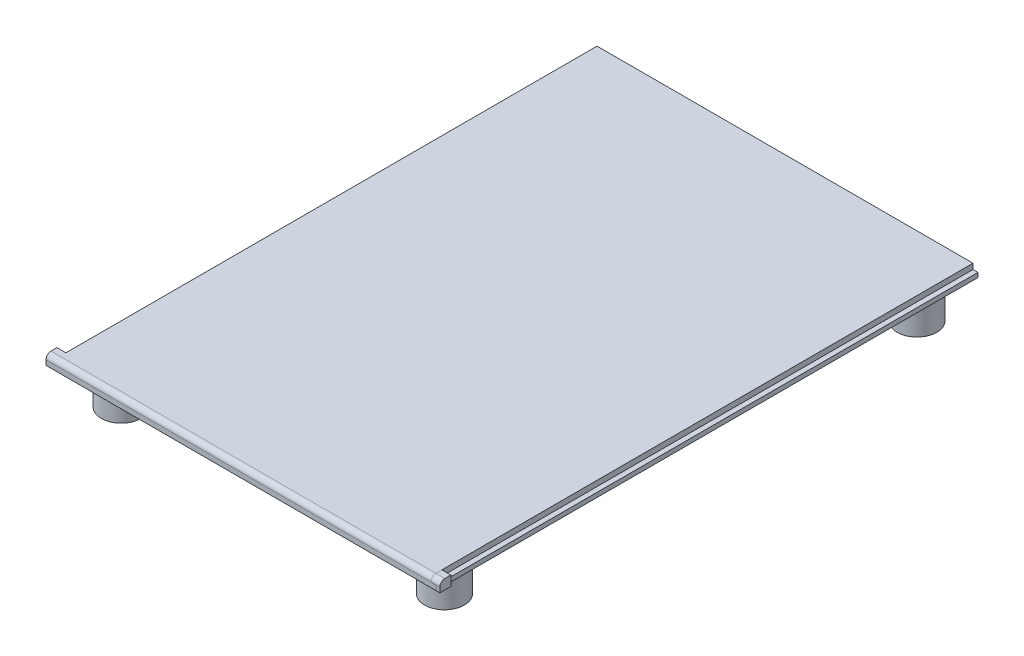
ISO-10303-21;
HEADER;
FILE_DESCRIPTION(('STEP AP214'),'2;1');
FILE_NAME('part.step','',(''),(''),'','','');
FILE_SCHEMA(('AUTOMOTIVE_DESIGN { 1 0 10303 214 1 1 1 1 }'));
ENDSEC;
DATA;
#1=APPLICATION_CONTEXT('core data for automotive mechanical design processes');
#2=APPLICATION_PROTOCOL_DEFINITION('international standard','automotive_design',2000,#1);
#3=PRODUCT_CONTEXT('',#1,'mechanical');
#4=PRODUCT('Part','Part','',(#3));
#5=PRODUCT_RELATED_PRODUCT_CATEGORY('part','',(#4));
#6=PRODUCT_DEFINITION_FORMATION('','',#4);
#7=PRODUCT_DEFINITION_CONTEXT('part definition',#1,'design');
#8=PRODUCT_DEFINITION('design','',#6,#7);
#9=PRODUCT_DEFINITION_SHAPE('','',#8);
#10=(LENGTH_UNIT() NAMED_UNIT(*) SI_UNIT(.MILLI.,.METRE.));
#11=(NAMED_UNIT(*) PLANE_ANGLE_UNIT() SI_UNIT($,.RADIAN.));
#12=(NAMED_UNIT(*) SI_UNIT($,.STERADIAN.) SOLID_ANGLE_UNIT());
#13=UNCERTAINTY_MEASURE_WITH_UNIT(LENGTH_MEASURE(1.E-05),#10,'distance_accuracy_value','');
#14=(GEOMETRIC_REPRESENTATION_CONTEXT(3) GLOBAL_UNCERTAINTY_ASSIGNED_CONTEXT((#13)) GLOBAL_UNIT_ASSIGNED_CONTEXT((#10,
#11,#12)) REPRESENTATION_CONTEXT('',''));
#15=CARTESIAN_POINT('',(0.,0.,0.));
#16=DIRECTION('',(0.,0.,1.));
#17=DIRECTION('',(1.,0.,0.));
#18=AXIS2_PLACEMENT_3D('',#15,#16,#17);
#19=CARTESIAN_POINT('',(76.6,0.,-2.2));
#20=DIRECTION('',(-1.,0.,0.));
#21=DIRECTION('',(0.,0.,1.));
#22=AXIS2_PLACEMENT_3D('',#19,#20,#21);
#23=PLANE('',#22);
#24=DIRECTION('',(0.,1.,0.));
#25=VECTOR('',#24,1.);
#26=CARTESIAN_POINT('',(76.6,0.,0.));
#27=LINE('',#26,#25);
#28=CARTESIAN_POINT('',(76.6,0.,0.));
#29=VERTEX_POINT('',#28);
#30=CARTESIAN_POINT('',(76.6,1.,0.));
#31=VERTEX_POINT('',#30);
#32=EDGE_CURVE('E91',#29,#31,#27,.T.);
#33=ORIENTED_EDGE('',*,*,#32,.T.);
#34=CARTESIAN_POINT('',(76.6,1.,-1.));
#35=DIRECTION('',(-1.,0.,0.));
#36=DIRECTION('',(0.,0.,1.));
#37=AXIS2_PLACEMENT_3D('',#34,#35,#36);
#38=CIRCLE('',#37,1.);
#39=CARTESIAN_POINT('',(76.6,2.,-1.));
#40=VERTEX_POINT('',#39);
#41=EDGE_CURVE('E12',#31,#40,#38,.T.);
#42=ORIENTED_EDGE('',*,*,#41,.T.);
#43=DIRECTION('',(0.,0.,1.));
#44=VECTOR('',#43,1.);
#45=CARTESIAN_POINT('',(76.6,2.,-2.2));
#46=LINE('',#45,#44);
#47=CARTESIAN_POINT('',(76.6,2.,-2.2));
#48=VERTEX_POINT('',#47);
#49=EDGE_CURVE('E121',#48,#40,#46,.T.);
#50=ORIENTED_EDGE('',*,*,#49,.F.);
#51=DIRECTION('',(0.,1.,0.));
#52=VECTOR('',#51,1.);
#53=CARTESIAN_POINT('',(76.6,0.,-2.2));
#54=LINE('',#53,#52);
#55=CARTESIAN_POINT('',(76.6,0.,-2.2));
#56=VERTEX_POINT('',#55);
#57=EDGE_CURVE('E112',#56,#48,#54,.T.);
#58=ORIENTED_EDGE('',*,*,#57,.F.);
#59=DIRECTION('',(0.,0.,1.));
#60=VECTOR('',#59,1.);
#61=CARTESIAN_POINT('',(76.6,0.,-2.2));
#62=LINE('',#61,#60);
#63=EDGE_CURVE('E106',#56,#29,#62,.T.);
#64=ORIENTED_EDGE('',*,*,#63,.T.);
#65=EDGE_LOOP('',(#33,#42,#50,#58,#64));
#66=FACE_BOUND('',#65,.T.);
#67=ADVANCED_FACE('F48',(#66),#23,.T.);
#68=CARTESIAN_POINT('',(76.6,0.,-2.2));
#69=DIRECTION('',(0.,0.,-1.));
#70=DIRECTION('',(-1.,0.,0.));
#71=AXIS2_PLACEMENT_3D('',#68,#69,#70);
#72=PLANE('',#71);
#73=DIRECTION('',(-1.,0.,0.));
#74=VECTOR('',#73,1.);
#75=CARTESIAN_POINT('',(76.6,2.,-2.2));
#76=LINE('',#75,#74);
#77=CARTESIAN_POINT('',(78.4,2.,-2.2));
#78=VERTEX_POINT('',#77);
#79=EDGE_CURVE('E113',#78,#48,#76,.T.);
#80=ORIENTED_EDGE('',*,*,#79,.F.);
#81=DIRECTION('',(0.,1.,0.));
#82=VECTOR('',#81,1.);
#83=CARTESIAN_POINT('',(78.4,0.,-2.2));
#84=LINE('',#83,#82);
#85=CARTESIAN_POINT('',(78.4,0.,-2.2));
#86=VERTEX_POINT('',#85);
#87=EDGE_CURVE('E127',#86,#78,#84,.T.);
#88=ORIENTED_EDGE('',*,*,#87,.F.);
#89=DIRECTION('',(-1.,0.,0.));
#90=VECTOR('',#89,1.);
#91=CARTESIAN_POINT('',(76.6,0.,-2.2));
#92=LINE('',#91,#90);
#93=EDGE_CURVE('E99',#86,#56,#92,.T.);
#94=ORIENTED_EDGE('',*,*,#93,.T.);
#95=ORIENTED_EDGE('',*,*,#57,.T.);
#96=EDGE_LOOP('',(#80,#88,#94,#95));
#97=FACE_BOUND('',#96,.T.);
#98=ADVANCED_FACE('F140',(#97),#72,.T.);
#99=CARTESIAN_POINT('',(78.4,0.,-2.2));
#100=DIRECTION('',(1.,0.,0.));
#101=DIRECTION('',(0.,0.,-1.));
#102=AXIS2_PLACEMENT_3D('',#99,#100,#101);
#103=PLANE('',#102);
#104=DIRECTION('',(0.,0.,-1.));
#105=VECTOR('',#104,1.);
#106=CARTESIAN_POINT('',(78.4,2.,-2.2));
#107=LINE('',#106,#105);
#108=CARTESIAN_POINT('',(78.4,2.,-1.));
#109=VERTEX_POINT('',#108);
#110=EDGE_CURVE('E116',#109,#78,#107,.T.);
#111=ORIENTED_EDGE('',*,*,#110,.F.);
#112=CARTESIAN_POINT('',(78.4,1.,-1.));
#113=DIRECTION('',(1.,0.,0.));
#114=DIRECTION('',(0.,0.,-1.));
#115=AXIS2_PLACEMENT_3D('',#112,#113,#114);
#116=CIRCLE('',#115,1.);
#117=CARTESIAN_POINT('',(78.4,1.,0.));
#118=VERTEX_POINT('',#117);
#119=EDGE_CURVE('E70',#109,#118,#116,.T.);
#120=ORIENTED_EDGE('',*,*,#119,.T.);
#121=DIRECTION('',(0.,1.,0.));
#122=VECTOR('',#121,1.);
#123=CARTESIAN_POINT('',(78.4,0.,0.));
#124=LINE('',#123,#122);
#125=CARTESIAN_POINT('',(78.4,0.,0.));
#126=VERTEX_POINT('',#125);
#127=EDGE_CURVE('E98',#126,#118,#124,.T.);
#128=ORIENTED_EDGE('',*,*,#127,.F.);
#129=DIRECTION('',(0.,0.,-1.));
#130=VECTOR('',#129,1.);
#131=CARTESIAN_POINT('',(78.4,0.,-2.2));
#132=LINE('',#131,#130);
#133=EDGE_CURVE('E109',#126,#86,#132,.T.);
#134=ORIENTED_EDGE('',*,*,#133,.T.);
#135=ORIENTED_EDGE('',*,*,#87,.T.);
#136=EDGE_LOOP('',(#111,#120,#128,#134,#135));
#137=FACE_BOUND('',#136,.T.);
#138=ADVANCED_FACE('F137',(#137),#103,.T.);
#139=CARTESIAN_POINT('',(76.6,0.,0.));
#140=DIRECTION('',(0.,0.,1.));
#141=DIRECTION('',(1.,0.,0.));
#142=AXIS2_PLACEMENT_3D('',#139,#140,#141);
#143=PLANE('',#142);
#144=ORIENTED_EDGE('',*,*,#127,.T.);
#145=DIRECTION('',(1.,0.,0.));
#146=VECTOR('',#145,1.);
#147=CARTESIAN_POINT('',(76.6,1.,0.));
#148=LINE('',#147,#146);
#149=EDGE_CURVE('E56',#118,#31,#148,.F.);
#150=ORIENTED_EDGE('',*,*,#149,.T.);
#151=ORIENTED_EDGE('',*,*,#32,.F.);
#152=DIRECTION('',(1.,0.,0.));
#153=VECTOR('',#152,1.);
#154=CARTESIAN_POINT('',(76.6,0.,0.));
#155=LINE('',#154,#153);
#156=EDGE_CURVE('E94',#29,#126,#155,.T.);
#157=ORIENTED_EDGE('',*,*,#156,.T.);
#158=EDGE_LOOP('',(#144,#150,#151,#157));
#159=FACE_BOUND('',#158,.T.);
#160=ADVANCED_FACE('F93',(#159),#143,.T.);
#161=CARTESIAN_POINT('',(0.,0.,0.));
#162=DIRECTION('',(0.,1.,0.));
#163=DIRECTION('',(0.,0.,1.));
#164=AXIS2_PLACEMENT_3D('',#161,#162,#163);
#165=PLANE('',#164);
#166=ORIENTED_EDGE('',*,*,#63,.F.);
#167=ORIENTED_EDGE('',*,*,#93,.F.);
#168=ORIENTED_EDGE('',*,*,#133,.F.);
#169=ORIENTED_EDGE('',*,*,#156,.F.);
#170=EDGE_LOOP('',(#166,#167,#168,#169));
#171=FACE_BOUND('',#170,.T.);
#172=ADVANCED_FACE('F104',(#171),#165,.F.);
#173=CARTESIAN_POINT('',(0.,2.,0.));
#174=DIRECTION('',(0.,1.,0.));
#175=DIRECTION('',(0.,0.,1.));
#176=AXIS2_PLACEMENT_3D('',#173,#174,#175);
#177=PLANE('',#176);
#178=ORIENTED_EDGE('',*,*,#49,.T.);
#179=DIRECTION('',(1.,0.,0.));
#180=VECTOR('',#179,1.);
#181=CARTESIAN_POINT('',(0.,2.,-1.));
#182=LINE('',#181,#180);
#183=EDGE_CURVE('E126',#40,#109,#182,.T.);
#184=ORIENTED_EDGE('',*,*,#183,.T.);
#185=ORIENTED_EDGE('',*,*,#110,.T.);
#186=ORIENTED_EDGE('',*,*,#79,.T.);
#187=EDGE_LOOP('',(#178,#184,#185,#186));
#188=FACE_BOUND('',#187,.T.);
#189=ADVANCED_FACE('F135',(#188),#177,.T.);
#190=CARTESIAN_POINT('',(0.,1.,-1.));
#191=DIRECTION('',(1.,0.,0.));
#192=DIRECTION('',(0.,0.,-1.));
#193=AXIS2_PLACEMENT_3D('',#190,#191,#192);
#194=CYLINDRICAL_SURFACE('',#193,1.);
#195=ORIENTED_EDGE('',*,*,#41,.F.);
#196=ORIENTED_EDGE('',*,*,#149,.F.);
#197=ORIENTED_EDGE('',*,*,#119,.F.);
#198=ORIENTED_EDGE('',*,*,#183,.F.);
#199=EDGE_LOOP('',(#195,#196,#197,#198));
#200=FACE_BOUND('',#199,.T.);
#201=ADVANCED_FACE('F50',(#200),#194,.T.);
#202=CLOSED_SHELL('',(#67,#98,#138,#160,#172,#189,#201));
#203=MANIFOLD_SOLID_BREP('B2',#202);
#204=CARTESIAN_POINT('',(0.,2.,0.));
#205=DIRECTION('',(1.,0.,0.));
#206=DIRECTION('',(0.,0.,-1.));
#207=AXIS2_PLACEMENT_3D('',#204,#205,#206);
#208=PLANE('',#207);
#209=DIRECTION('',(0.,0.,1.));
#210=VECTOR('',#209,1.);
#211=CARTESIAN_POINT('',(0.,0.,0.));
#212=LINE('',#211,#210);
#213=CARTESIAN_POINT('',(0.,0.,-109.));
#214=VERTEX_POINT('',#213);
#215=CARTESIAN_POINT('',(0.,0.,-2.2));
#216=VERTEX_POINT('',#215);
#217=EDGE_CURVE('E380',#214,#216,#212,.T.);
#218=ORIENTED_EDGE('',*,*,#217,.T.);
#219=DIRECTION('',(0.,1.,0.));
#220=VECTOR('',#219,1.);
#221=CARTESIAN_POINT('',(0.,2.,-2.2));
#222=LINE('',#221,#220);
#223=CARTESIAN_POINT('',(0.,0.9,-2.2));
#224=VERTEX_POINT('',#223);
#225=EDGE_CURVE('E285',#216,#224,#222,.T.);
#226=ORIENTED_EDGE('',*,*,#225,.T.);
#227=DIRECTION('',(0.,0.,1.));
#228=VECTOR('',#227,1.);
#229=CARTESIAN_POINT('',(0.,0.9,0.));
#230=LINE('',#229,#228);
#231=CARTESIAN_POINT('',(0.,0.9,-109.));
#232=VERTEX_POINT('',#231);
#233=EDGE_CURVE('E383',#232,#224,#230,.T.);
#234=ORIENTED_EDGE('',*,*,#233,.F.);
#235=DIRECTION('',(0.,-1.,0.));
#236=VECTOR('',#235,1.);
#237=CARTESIAN_POINT('',(0.,2.,-109.));
#238=LINE('',#237,#236);
#239=EDGE_CURVE('E403',#232,#214,#238,.T.);
#240=ORIENTED_EDGE('',*,*,#239,.T.);
#241=EDGE_LOOP('',(#218,#226,#234,#240));
#242=FACE_BOUND('',#241,.T.);
#243=ADVANCED_FACE('F197',(#242),#208,.F.);
#244=CARTESIAN_POINT('',(0.,2.,0.));
#245=DIRECTION('',(0.,0.,-1.));
#246=DIRECTION('',(-1.,0.,0.));
#247=AXIS2_PLACEMENT_3D('',#244,#245,#246);
#248=PLANE('',#247);
#249=DIRECTION('',(0.,1.,0.));
#250=VECTOR('',#249,1.);
#251=CARTESIAN_POINT('',(76.6,0.9,0.));
#252=LINE('',#251,#250);
#253=CARTESIAN_POINT('',(76.6,0.9,0.));
#254=VERTEX_POINT('',#253);
#255=CARTESIAN_POINT('',(76.6,1.,0.));
#256=VERTEX_POINT('',#255);
#257=EDGE_CURVE('E377',#254,#256,#252,.T.);
#258=ORIENTED_EDGE('',*,*,#257,.T.);
#259=DIRECTION('',(1.,0.,0.));
#260=VECTOR('',#259,1.);
#261=CARTESIAN_POINT('',(0.,1.,0.));
#262=LINE('',#261,#260);
#263=CARTESIAN_POINT('',(-0.799999999999999,1.,0.));
#264=VERTEX_POINT('',#263);
#265=EDGE_CURVE('E206',#256,#264,#262,.F.);
#266=ORIENTED_EDGE('',*,*,#265,.T.);
#267=DIRECTION('',(0.,1.,0.));
#268=VECTOR('',#267,1.);
#269=CARTESIAN_POINT('',(-0.799999999999999,0.,0.));
#270=LINE('',#269,#268);
#271=CARTESIAN_POINT('',(-0.799999999999999,0.,0.));
#272=VERTEX_POINT('',#271);
#273=EDGE_CURVE('E300',#272,#264,#270,.T.);
#274=ORIENTED_EDGE('',*,*,#273,.F.);
#275=DIRECTION('',(1.,0.,0.));
#276=VECTOR('',#275,1.);
#277=CARTESIAN_POINT('',(0.,0.,0.));
#278=LINE('',#277,#276);
#279=CARTESIAN_POINT('',(77.6,0.,0.));
#280=VERTEX_POINT('',#279);
#281=EDGE_CURVE('E306',#272,#280,#278,.T.);
#282=ORIENTED_EDGE('',*,*,#281,.T.);
#283=DIRECTION('',(0.,-1.,0.));
#284=VECTOR('',#283,1.);
#285=CARTESIAN_POINT('',(77.6,2.,0.));
#286=LINE('',#285,#284);
#287=CARTESIAN_POINT('',(77.6,0.9,0.));
#288=VERTEX_POINT('',#287);
#289=EDGE_CURVE('E421',#288,#280,#286,.T.);
#290=ORIENTED_EDGE('',*,*,#289,.F.);
#291=DIRECTION('',(1.,0.,0.));
#292=VECTOR('',#291,1.);
#293=CARTESIAN_POINT('',(77.6,0.9,0.));
#294=LINE('',#293,#292);
#295=EDGE_CURVE('E370',#254,#288,#294,.T.);
#296=ORIENTED_EDGE('',*,*,#295,.F.);
#297=EDGE_LOOP('',(#258,#266,#274,#282,#290,#296));
#298=FACE_BOUND('',#297,.T.);
#299=ADVANCED_FACE('F493',(#298),#248,.F.);
#300=CARTESIAN_POINT('',(77.6,2.,0.));
#301=DIRECTION('',(-1.,0.,0.));
#302=DIRECTION('',(0.,0.,1.));
#303=AXIS2_PLACEMENT_3D('',#300,#301,#302);
#304=PLANE('',#303);
#305=DIRECTION('',(0.,-1.,0.));
#306=VECTOR('',#305,1.);
#307=CARTESIAN_POINT('',(77.6,2.,-109.));
#308=LINE('',#307,#306);
#309=CARTESIAN_POINT('',(77.6,0.9,-109.));
#310=VERTEX_POINT('',#309);
#311=CARTESIAN_POINT('',(77.6,0.,-109.));
#312=VERTEX_POINT('',#311);
#313=EDGE_CURVE('E418',#310,#312,#308,.T.);
#314=ORIENTED_EDGE('',*,*,#313,.F.);
#315=DIRECTION('',(0.,0.,-1.));
#316=VECTOR('',#315,1.);
#317=CARTESIAN_POINT('',(77.6,0.9,-109.));
#318=LINE('',#317,#316);
#319=EDGE_CURVE('E358',#288,#310,#318,.T.);
#320=ORIENTED_EDGE('',*,*,#319,.F.);
#321=ORIENTED_EDGE('',*,*,#289,.T.);
#322=DIRECTION('',(0.,0.,-1.));
#323=VECTOR('',#322,1.);
#324=CARTESIAN_POINT('',(77.6,0.,0.));
#325=LINE('',#324,#323);
#326=EDGE_CURVE('E409',#280,#312,#325,.T.);
#327=ORIENTED_EDGE('',*,*,#326,.T.);
#328=EDGE_LOOP('',(#314,#320,#321,#327));
#329=FACE_BOUND('',#328,.T.);
#330=ADVANCED_FACE('F489',(#329),#304,.F.);
#331=CARTESIAN_POINT('',(0.,2.,-109.));
#332=DIRECTION('',(0.,0.,1.));
#333=DIRECTION('',(1.,0.,0.));
#334=AXIS2_PLACEMENT_3D('',#331,#332,#333);
#335=PLANE('',#334);
#336=DIRECTION('',(-1.,0.,0.));
#337=VECTOR('',#336,1.);
#338=CARTESIAN_POINT('',(0.,2.,-109.));
#339=LINE('',#338,#337);
#340=CARTESIAN_POINT('',(76.6,2.,-109.));
#341=VERTEX_POINT('',#340);
#342=CARTESIAN_POINT('',(1.,2.,-109.));
#343=VERTEX_POINT('',#342);
#344=EDGE_CURVE('E399',#341,#343,#339,.T.);
#345=ORIENTED_EDGE('',*,*,#344,.F.);
#346=DIRECTION('',(0.,1.,0.));
#347=VECTOR('',#346,1.);
#348=CARTESIAN_POINT('',(76.6,0.9,-109.));
#349=LINE('',#348,#347);
#350=CARTESIAN_POINT('',(76.6,0.9,-109.));
#351=VERTEX_POINT('',#350);
#352=EDGE_CURVE('E373',#351,#341,#349,.T.);
#353=ORIENTED_EDGE('',*,*,#352,.F.);
#354=DIRECTION('',(-1.,0.,0.));
#355=VECTOR('',#354,1.);
#356=CARTESIAN_POINT('',(77.6,0.9,-109.));
#357=LINE('',#356,#355);
#358=EDGE_CURVE('E361',#310,#351,#357,.T.);
#359=ORIENTED_EDGE('',*,*,#358,.F.);
#360=ORIENTED_EDGE('',*,*,#313,.T.);
#361=DIRECTION('',(-1.,0.,0.));
#362=VECTOR('',#361,1.);
#363=CARTESIAN_POINT('',(0.,0.,-109.));
#364=LINE('',#363,#362);
#365=EDGE_CURVE('E404',#312,#214,#364,.T.);
#366=ORIENTED_EDGE('',*,*,#365,.T.);
#367=ORIENTED_EDGE('',*,*,#239,.F.);
#368=DIRECTION('',(-1.,0.,0.));
#369=VECTOR('',#368,1.);
#370=CARTESIAN_POINT('',(0.,0.9,-109.));
#371=LINE('',#370,#369);
#372=CARTESIAN_POINT('',(1.,0.9,-109.));
#373=VERTEX_POINT('',#372);
#374=EDGE_CURVE('E391',#373,#232,#371,.T.);
#375=ORIENTED_EDGE('',*,*,#374,.F.);
#376=DIRECTION('',(0.,1.,0.));
#377=VECTOR('',#376,1.);
#378=CARTESIAN_POINT('',(1.,0.9,-109.));
#379=LINE('',#378,#377);
#380=EDGE_CURVE('E376',#373,#343,#379,.T.);
#381=ORIENTED_EDGE('',*,*,#380,.T.);
#382=EDGE_LOOP('',(#345,#353,#359,#360,#366,#367,#375,#381));
#383=FACE_BOUND('',#382,.T.);
#384=ADVANCED_FACE('F474',(#383),#335,.F.);
#385=CARTESIAN_POINT('',(0.,2.,0.));
#386=DIRECTION('',(0.,-1.,0.));
#387=DIRECTION('',(0.,0.,-1.));
#388=AXIS2_PLACEMENT_3D('',#385,#386,#387);
#389=PLANE('',#388);
#390=DIRECTION('',(0.,0.,1.));
#391=VECTOR('',#390,1.);
#392=CARTESIAN_POINT('',(-0.799999999999999,2.,-2.2));
#393=LINE('',#392,#391);
#394=CARTESIAN_POINT('',(-0.799999999999999,2.,-2.2));
#395=VERTEX_POINT('',#394);
#396=CARTESIAN_POINT('',(-0.799999999999999,2.,-1.));
#397=VERTEX_POINT('',#396);
#398=EDGE_CURVE('E292',#395,#397,#393,.T.);
#399=ORIENTED_EDGE('',*,*,#398,.T.);
#400=DIRECTION('',(1.,0.,0.));
#401=VECTOR('',#400,1.);
#402=CARTESIAN_POINT('',(0.,2.,-1.));
#403=LINE('',#402,#401);
#404=CARTESIAN_POINT('',(76.6,2.,-1.));
#405=VERTEX_POINT('',#404);
#406=EDGE_CURVE('E457',#397,#405,#403,.T.);
#407=ORIENTED_EDGE('',*,*,#406,.T.);
#408=DIRECTION('',(0.,0.,1.));
#409=VECTOR('',#408,1.);
#410=CARTESIAN_POINT('',(76.6,2.,-109.));
#411=LINE('',#410,#409);
#412=EDGE_CURVE('E362',#341,#405,#411,.T.);
#413=ORIENTED_EDGE('',*,*,#412,.F.);
#414=ORIENTED_EDGE('',*,*,#344,.T.);
#415=DIRECTION('',(0.,0.,-1.));
#416=VECTOR('',#415,1.);
#417=CARTESIAN_POINT('',(1.,2.,0.));
#418=LINE('',#417,#416);
#419=CARTESIAN_POINT('',(1.,2.,-2.2));
#420=VERTEX_POINT('',#419);
#421=EDGE_CURVE('E388',#420,#343,#418,.T.);
#422=ORIENTED_EDGE('',*,*,#421,.F.);
#423=DIRECTION('',(-1.,0.,0.));
#424=VECTOR('',#423,1.);
#425=CARTESIAN_POINT('',(1.,2.,-2.2));
#426=LINE('',#425,#424);
#427=EDGE_CURVE('E313',#420,#395,#426,.T.);
#428=ORIENTED_EDGE('',*,*,#427,.T.);
#429=EDGE_LOOP('',(#399,#407,#413,#414,#422,#428));
#430=FACE_BOUND('',#429,.T.);
#431=ADVANCED_FACE('F466',(#430),#389,.F.);
#432=CARTESIAN_POINT('',(0.,0.,0.));
#433=DIRECTION('',(0.,-1.,0.));
#434=DIRECTION('',(0.,0.,-1.));
#435=AXIS2_PLACEMENT_3D('',#432,#433,#434);
#436=PLANE('',#435);
#437=ORIENTED_EDGE('',*,*,#326,.F.);
#438=ORIENTED_EDGE('',*,*,#281,.F.);
#439=DIRECTION('',(0.,0.,1.));
#440=VECTOR('',#439,1.);
#441=CARTESIAN_POINT('',(-0.799999999999999,0.,-2.2));
#442=LINE('',#441,#440);
#443=CARTESIAN_POINT('',(-0.799999999999999,0.,-2.2));
#444=VERTEX_POINT('',#443);
#445=EDGE_CURVE('E291',#444,#272,#442,.T.);
#446=ORIENTED_EDGE('',*,*,#445,.F.);
#447=DIRECTION('',(-1.,0.,0.));
#448=VECTOR('',#447,1.);
#449=CARTESIAN_POINT('',(1.,0.,-2.2));
#450=LINE('',#449,#448);
#451=EDGE_CURVE('E279',#216,#444,#450,.T.);
#452=ORIENTED_EDGE('',*,*,#451,.F.);
#453=ORIENTED_EDGE('',*,*,#217,.F.);
#454=ORIENTED_EDGE('',*,*,#365,.F.);
#455=EDGE_LOOP('',(#437,#438,#446,#452,#453,#454));
#456=FACE_BOUND('',#455,.T.);
#457=CARTESIAN_POINT('',(71.,0.,-103.319481559447));
#458=DIRECTION('',(0.,-1.,0.));
#459=DIRECTION('',(0.,0.,-1.));
#460=AXIS2_PLACEMENT_3D('',#457,#458,#459);
#461=CIRCLE('',#460,4.00000000000001);
#462=CARTESIAN_POINT('',(71.,0.,-107.319481559447));
#463=VERTEX_POINT('',#462);
#464=EDGE_CURVE('E446',#463,#463,#461,.T.);
#465=ORIENTED_EDGE('',*,*,#464,.F.);
#466=EDGE_LOOP('',(#465));
#467=FACE_BOUND('',#466,.T.);
#468=CARTESIAN_POINT('',(71.,0.,-8.31948155944673));
#469=DIRECTION('',(0.,-1.,0.));
#470=DIRECTION('',(0.,0.,-1.));
#471=AXIS2_PLACEMENT_3D('',#468,#469,#470);
#472=CIRCLE('',#471,4.00000000000001);
#473=CARTESIAN_POINT('',(71.,0.,-12.3194815594467));
#474=VERTEX_POINT('',#473);
#475=EDGE_CURVE('E439',#474,#474,#472,.T.);
#476=ORIENTED_EDGE('',*,*,#475,.F.);
#477=EDGE_LOOP('',(#476));
#478=FACE_BOUND('',#477,.T.);
#479=CARTESIAN_POINT('',(6.00000000000001,0.,-8.31948155944673));
#480=DIRECTION('',(0.,-1.,0.));
#481=DIRECTION('',(0.,0.,-1.));
#482=AXIS2_PLACEMENT_3D('',#479,#480,#481);
#483=CIRCLE('',#482,4.);
#484=CARTESIAN_POINT('',(6.00000000000001,0.,-12.3194815594467));
#485=VERTEX_POINT('',#484);
#486=EDGE_CURVE('E432',#485,#485,#483,.T.);
#487=ORIENTED_EDGE('',*,*,#486,.F.);
#488=EDGE_LOOP('',(#487));
#489=FACE_BOUND('',#488,.T.);
#490=CARTESIAN_POINT('',(6.,0.,-103.319481559447));
#491=DIRECTION('',(0.,-1.,0.));
#492=DIRECTION('',(0.,0.,-1.));
#493=AXIS2_PLACEMENT_3D('',#490,#491,#492);
#494=CIRCLE('',#493,4.);
#495=CARTESIAN_POINT('',(6.,0.,-107.319481559447));
#496=VERTEX_POINT('',#495);
#497=EDGE_CURVE('E425',#496,#496,#494,.T.);
#498=ORIENTED_EDGE('',*,*,#497,.F.);
#499=EDGE_LOOP('',(#498));
#500=FACE_BOUND('',#499,.T.);
#501=ADVANCED_FACE('F304',(#456,#467,#478,#489,#500),#436,.T.);
#502=CARTESIAN_POINT('',(1.,0.9,0.));
#503=DIRECTION('',(1.,0.,0.));
#504=DIRECTION('',(0.,0.,-1.));
#505=AXIS2_PLACEMENT_3D('',#502,#503,#504);
#506=PLANE('',#505);
#507=DIRECTION('',(0.,0.,-1.));
#508=VECTOR('',#507,1.);
#509=CARTESIAN_POINT('',(1.,0.9,0.));
#510=LINE('',#509,#508);
#511=CARTESIAN_POINT('',(1.,0.9,-2.2));
#512=VERTEX_POINT('',#511);
#513=EDGE_CURVE('E387',#512,#373,#510,.T.);
#514=ORIENTED_EDGE('',*,*,#513,.F.);
#515=DIRECTION('',(0.,1.,0.));
#516=VECTOR('',#515,1.);
#517=CARTESIAN_POINT('',(1.,0.,-2.2));
#518=LINE('',#517,#516);
#519=EDGE_CURVE('E301',#512,#420,#518,.T.);
#520=ORIENTED_EDGE('',*,*,#519,.T.);
#521=ORIENTED_EDGE('',*,*,#421,.T.);
#522=ORIENTED_EDGE('',*,*,#380,.F.);
#523=EDGE_LOOP('',(#514,#520,#521,#522));
#524=FACE_BOUND('',#523,.T.);
#525=ADVANCED_FACE('F481',(#524),#506,.F.);
#526=CARTESIAN_POINT('',(0.,0.9,0.));
#527=DIRECTION('',(0.,-1.,0.));
#528=DIRECTION('',(0.,0.,-1.));
#529=AXIS2_PLACEMENT_3D('',#526,#527,#528);
#530=PLANE('',#529);
#531=ORIENTED_EDGE('',*,*,#233,.T.);
#532=DIRECTION('',(1.,0.,0.));
#533=VECTOR('',#532,1.);
#534=CARTESIAN_POINT('',(0.,0.9,-2.2));
#535=LINE('',#534,#533);
#536=EDGE_CURVE('E453',#224,#512,#535,.T.);
#537=ORIENTED_EDGE('',*,*,#536,.T.);
#538=ORIENTED_EDGE('',*,*,#513,.T.);
#539=ORIENTED_EDGE('',*,*,#374,.T.);
#540=EDGE_LOOP('',(#531,#537,#538,#539));
#541=FACE_BOUND('',#540,.T.);
#542=ADVANCED_FACE('F483',(#541),#530,.F.);
#543=CARTESIAN_POINT('',(76.6,0.9,-109.));
#544=DIRECTION('',(-1.,0.,0.));
#545=DIRECTION('',(0.,0.,1.));
#546=AXIS2_PLACEMENT_3D('',#543,#544,#545);
#547=PLANE('',#546);
#548=ORIENTED_EDGE('',*,*,#412,.T.);
#549=CARTESIAN_POINT('',(76.6,1.,-1.));
#550=DIRECTION('',(-1.,0.,0.));
#551=DIRECTION('',(0.,0.,1.));
#552=AXIS2_PLACEMENT_3D('',#549,#550,#551);
#553=CIRCLE('',#552,1.);
#554=EDGE_CURVE('E220',#405,#256,#553,.F.);
#555=ORIENTED_EDGE('',*,*,#554,.T.);
#556=ORIENTED_EDGE('',*,*,#257,.F.);
#557=DIRECTION('',(0.,0.,1.));
#558=VECTOR('',#557,1.);
#559=CARTESIAN_POINT('',(76.6,0.9,-109.));
#560=LINE('',#559,#558);
#561=EDGE_CURVE('E366',#351,#254,#560,.T.);
#562=ORIENTED_EDGE('',*,*,#561,.F.);
#563=ORIENTED_EDGE('',*,*,#352,.T.);
#564=EDGE_LOOP('',(#548,#555,#556,#562,#563));
#565=FACE_BOUND('',#564,.T.);
#566=ADVANCED_FACE('F470',(#565),#547,.F.);
#567=CARTESIAN_POINT('',(0.,0.9,0.));
#568=DIRECTION('',(0.,-1.,0.));
#569=DIRECTION('',(0.,0.,-1.));
#570=AXIS2_PLACEMENT_3D('',#567,#568,#569);
#571=PLANE('',#570);
#572=ORIENTED_EDGE('',*,*,#319,.T.);
#573=ORIENTED_EDGE('',*,*,#358,.T.);
#574=ORIENTED_EDGE('',*,*,#561,.T.);
#575=ORIENTED_EDGE('',*,*,#295,.T.);
#576=EDGE_LOOP('',(#572,#573,#574,#575));
#577=FACE_BOUND('',#576,.T.);
#578=ADVANCED_FACE('F521',(#577),#571,.F.);
#579=CARTESIAN_POINT('',(6.,-8.,-103.319481559447));
#580=DIRECTION('',(0.,1.,0.));
#581=DIRECTION('',(0.,0.,1.));
#582=AXIS2_PLACEMENT_3D('',#579,#580,#581);
#583=CYLINDRICAL_SURFACE('',#582,4.);
#584=ORIENTED_EDGE('',*,*,#497,.T.);
#585=EDGE_LOOP('',(#584));
#586=FACE_BOUND('',#585,.T.);
#587=CARTESIAN_POINT('',(6.,-8.,-103.319481559447));
#588=DIRECTION('',(0.,1.,0.));
#589=DIRECTION('',(0.,0.,1.));
#590=AXIS2_PLACEMENT_3D('',#587,#588,#589);
#591=CIRCLE('',#590,4.);
#592=CARTESIAN_POINT('',(6.,-8.,-99.3194815594467));
#593=VERTEX_POINT('',#592);
#594=EDGE_CURVE('E353',#593,#593,#591,.T.);
#595=ORIENTED_EDGE('',*,*,#594,.T.);
#596=EDGE_LOOP('',(#595));
#597=FACE_BOUND('',#596,.T.);
#598=ADVANCED_FACE('F524',(#586,#597),#583,.T.);
#599=CARTESIAN_POINT('',(6.,-8.,-103.319481559447));
#600=DIRECTION('',(0.,1.,0.));
#601=DIRECTION('',(0.,0.,1.));
#602=AXIS2_PLACEMENT_3D('',#599,#600,#601);
#603=PLANE('',#602);
#604=CARTESIAN_POINT('',(6.,-8.,-103.319481559447));
#605=DIRECTION('',(0.,1.,0.));
#606=DIRECTION('',(0.,0.,1.));
#607=AXIS2_PLACEMENT_3D('',#604,#605,#606);
#608=CIRCLE('',#607,1.5);
#609=CARTESIAN_POINT('',(6.,-8.,-101.819481559447));
#610=VERTEX_POINT('',#609);
#611=EDGE_CURVE('E349',#610,#610,#608,.T.);
#612=ORIENTED_EDGE('',*,*,#611,.T.);
#613=EDGE_LOOP('',(#612));
#614=FACE_BOUND('',#613,.T.);
#615=ORIENTED_EDGE('',*,*,#594,.F.);
#616=EDGE_LOOP('',(#615));
#617=FACE_BOUND('',#616,.T.);
#618=ADVANCED_FACE('F528',(#614,#617),#603,.F.);
#619=CARTESIAN_POINT('',(6.,-8.,-103.319481559447));
#620=DIRECTION('',(0.,1.,0.));
#621=DIRECTION('',(0.,0.,1.));
#622=AXIS2_PLACEMENT_3D('',#619,#620,#621);
#623=CYLINDRICAL_SURFACE('',#622,1.5);
#624=CARTESIAN_POINT('',(6.,0.,-103.319481559447));
#625=DIRECTION('',(0.,-1.,0.));
#626=DIRECTION('',(0.,0.,-1.));
#627=AXIS2_PLACEMENT_3D('',#624,#625,#626);
#628=CIRCLE('',#627,1.5);
#629=CARTESIAN_POINT('',(6.,0.,-104.819481559447));
#630=VERTEX_POINT('',#629);
#631=EDGE_CURVE('E357',#630,#630,#628,.T.);
#632=ORIENTED_EDGE('',*,*,#631,.F.);
#633=EDGE_LOOP('',(#632));
#634=FACE_BOUND('',#633,.T.);
#635=ORIENTED_EDGE('',*,*,#611,.F.);
#636=EDGE_LOOP('',(#635));
#637=FACE_BOUND('',#636,.T.);
#638=ADVANCED_FACE('F532',(#634,#637),#623,.F.);
#639=ORIENTED_EDGE('',*,*,#631,.T.);
#640=EDGE_LOOP('',(#639));
#641=FACE_BOUND('',#640,.T.);
#642=ADVANCED_FACE('F512',(#641),#436,.T.);
#643=CARTESIAN_POINT('',(6.00000000000001,-8.,-8.31948155944673));
#644=DIRECTION('',(0.,1.,0.));
#645=DIRECTION('',(0.,0.,1.));
#646=AXIS2_PLACEMENT_3D('',#643,#644,#645);
#647=CYLINDRICAL_SURFACE('',#646,4.);
#648=ORIENTED_EDGE('',*,*,#486,.T.);
#649=EDGE_LOOP('',(#648));
#650=FACE_BOUND('',#649,.T.);
#651=CARTESIAN_POINT('',(6.00000000000001,-8.,-8.31948155944673));
#652=DIRECTION('',(0.,1.,0.));
#653=DIRECTION('',(0.,0.,1.));
#654=AXIS2_PLACEMENT_3D('',#651,#652,#653);
#655=CIRCLE('',#654,4.);
#656=CARTESIAN_POINT('',(6.00000000000001,-8.,-4.31948155944673));
#657=VERTEX_POINT('',#656);
#658=EDGE_CURVE('E344',#657,#657,#655,.T.);
#659=ORIENTED_EDGE('',*,*,#658,.T.);
#660=EDGE_LOOP('',(#659));
#661=FACE_BOUND('',#660,.T.);
#662=ADVANCED_FACE('F537',(#650,#661),#647,.T.);
#663=CARTESIAN_POINT('',(6.00000000000001,-8.,-8.31948155944673));
#664=DIRECTION('',(0.,1.,0.));
#665=DIRECTION('',(0.,0.,1.));
#666=AXIS2_PLACEMENT_3D('',#663,#664,#665);
#667=PLANE('',#666);
#668=CARTESIAN_POINT('',(6.00000000000001,-8.,-8.31948155944673));
#669=DIRECTION('',(0.,1.,0.));
#670=DIRECTION('',(0.,0.,1.));
#671=AXIS2_PLACEMENT_3D('',#668,#669,#670);
#672=CIRCLE('',#671,1.5);
#673=CARTESIAN_POINT('',(6.00000000000001,-8.,-6.81948155944673));
#674=VERTEX_POINT('',#673);
#675=EDGE_CURVE('E340',#674,#674,#672,.T.);
#676=ORIENTED_EDGE('',*,*,#675,.T.);
#677=EDGE_LOOP('',(#676));
#678=FACE_BOUND('',#677,.T.);
#679=ORIENTED_EDGE('',*,*,#658,.F.);
#680=EDGE_LOOP('',(#679));
#681=FACE_BOUND('',#680,.T.);
#682=ADVANCED_FACE('F540',(#678,#681),#667,.F.);
#683=CARTESIAN_POINT('',(6.00000000000001,-8.,-8.31948155944673));
#684=DIRECTION('',(0.,1.,0.));
#685=DIRECTION('',(0.,0.,1.));
#686=AXIS2_PLACEMENT_3D('',#683,#684,#685);
#687=CYLINDRICAL_SURFACE('',#686,1.5);
#688=CARTESIAN_POINT('',(6.00000000000001,0.,-8.31948155944673));
#689=DIRECTION('',(0.,-1.,0.));
#690=DIRECTION('',(0.,0.,-1.));
#691=AXIS2_PLACEMENT_3D('',#688,#689,#690);
#692=CIRCLE('',#691,1.5);
#693=CARTESIAN_POINT('',(6.00000000000001,0.,-9.81948155944673));
#694=VERTEX_POINT('',#693);
#695=EDGE_CURVE('E348',#694,#694,#692,.T.);
#696=ORIENTED_EDGE('',*,*,#695,.F.);
#697=EDGE_LOOP('',(#696));
#698=FACE_BOUND('',#697,.T.);
#699=ORIENTED_EDGE('',*,*,#675,.F.);
#700=EDGE_LOOP('',(#699));
#701=FACE_BOUND('',#700,.T.);
#702=ADVANCED_FACE('F544',(#698,#701),#687,.F.);
#703=ORIENTED_EDGE('',*,*,#695,.T.);
#704=EDGE_LOOP('',(#703));
#705=FACE_BOUND('',#704,.T.);
#706=ADVANCED_FACE('F548',(#705),#436,.T.);
#707=CARTESIAN_POINT('',(71.,-8.,-8.31948155944673));
#708=DIRECTION('',(0.,1.,0.));
#709=DIRECTION('',(0.,0.,1.));
#710=AXIS2_PLACEMENT_3D('',#707,#708,#709);
#711=CYLINDRICAL_SURFACE('',#710,4.00000000000001);
#712=ORIENTED_EDGE('',*,*,#475,.T.);
#713=EDGE_LOOP('',(#712));
#714=FACE_BOUND('',#713,.T.);
#715=CARTESIAN_POINT('',(71.,-8.,-8.31948155944673));
#716=DIRECTION('',(0.,1.,0.));
#717=DIRECTION('',(0.,0.,1.));
#718=AXIS2_PLACEMENT_3D('',#715,#716,#717);
#719=CIRCLE('',#718,4.00000000000001);
#720=CARTESIAN_POINT('',(71.,-8.,-4.31948155944672));
#721=VERTEX_POINT('',#720);
#722=EDGE_CURVE('E335',#721,#721,#719,.T.);
#723=ORIENTED_EDGE('',*,*,#722,.T.);
#724=EDGE_LOOP('',(#723));
#725=FACE_BOUND('',#724,.T.);
#726=ADVANCED_FACE('F550',(#714,#725),#711,.T.);
#727=CARTESIAN_POINT('',(71.,-8.,-8.31948155944673));
#728=DIRECTION('',(0.,1.,0.));
#729=DIRECTION('',(0.,0.,1.));
#730=AXIS2_PLACEMENT_3D('',#727,#728,#729);
#731=PLANE('',#730);
#732=CARTESIAN_POINT('',(71.,-8.,-8.31948155944673));
#733=DIRECTION('',(0.,1.,0.));
#734=DIRECTION('',(0.,0.,1.));
#735=AXIS2_PLACEMENT_3D('',#732,#733,#734);
#736=CIRCLE('',#735,1.5);
#737=CARTESIAN_POINT('',(71.,-8.,-6.81948155944673));
#738=VERTEX_POINT('',#737);
#739=EDGE_CURVE('E331',#738,#738,#736,.T.);
#740=ORIENTED_EDGE('',*,*,#739,.T.);
#741=EDGE_LOOP('',(#740));
#742=FACE_BOUND('',#741,.T.);
#743=ORIENTED_EDGE('',*,*,#722,.F.);
#744=EDGE_LOOP('',(#743));
#745=FACE_BOUND('',#744,.T.);
#746=ADVANCED_FACE('F553',(#742,#745),#731,.F.);
#747=CARTESIAN_POINT('',(71.,-8.,-8.31948155944673));
#748=DIRECTION('',(0.,1.,0.));
#749=DIRECTION('',(0.,0.,1.));
#750=AXIS2_PLACEMENT_3D('',#747,#748,#749);
#751=CYLINDRICAL_SURFACE('',#750,1.5);
#752=CARTESIAN_POINT('',(71.,0.,-8.31948155944673));
#753=DIRECTION('',(0.,-1.,0.));
#754=DIRECTION('',(0.,0.,-1.));
#755=AXIS2_PLACEMENT_3D('',#752,#753,#754);
#756=CIRCLE('',#755,1.5);
#757=CARTESIAN_POINT('',(71.,0.,-9.81948155944673));
#758=VERTEX_POINT('',#757);
#759=EDGE_CURVE('E339',#758,#758,#756,.T.);
#760=ORIENTED_EDGE('',*,*,#759,.F.);
#761=EDGE_LOOP('',(#760));
#762=FACE_BOUND('',#761,.T.);
#763=ORIENTED_EDGE('',*,*,#739,.F.);
#764=EDGE_LOOP('',(#763));
#765=FACE_BOUND('',#764,.T.);
#766=ADVANCED_FACE('F557',(#762,#765),#751,.F.);
#767=ORIENTED_EDGE('',*,*,#759,.T.);
#768=EDGE_LOOP('',(#767));
#769=FACE_BOUND('',#768,.T.);
#770=ADVANCED_FACE('F561',(#769),#436,.T.);
#771=CARTESIAN_POINT('',(71.,-8.,-103.319481559447));
#772=DIRECTION('',(0.,1.,0.));
#773=DIRECTION('',(0.,0.,1.));
#774=AXIS2_PLACEMENT_3D('',#771,#772,#773);
#775=CYLINDRICAL_SURFACE('',#774,4.00000000000001);
#776=ORIENTED_EDGE('',*,*,#464,.T.);
#777=EDGE_LOOP('',(#776));
#778=FACE_BOUND('',#777,.T.);
#779=CARTESIAN_POINT('',(71.,-8.,-103.319481559447));
#780=DIRECTION('',(0.,1.,0.));
#781=DIRECTION('',(0.,0.,1.));
#782=AXIS2_PLACEMENT_3D('',#779,#780,#781);
#783=CIRCLE('',#782,4.00000000000001);
#784=CARTESIAN_POINT('',(71.,-8.,-99.3194815594467));
#785=VERTEX_POINT('',#784);
#786=EDGE_CURVE('E326',#785,#785,#783,.T.);
#787=ORIENTED_EDGE('',*,*,#786,.T.);
#788=EDGE_LOOP('',(#787));
#789=FACE_BOUND('',#788,.T.);
#790=ADVANCED_FACE('F563',(#778,#789),#775,.T.);
#791=CARTESIAN_POINT('',(71.,-8.,-103.319481559447));
#792=DIRECTION('',(0.,1.,0.));
#793=DIRECTION('',(0.,0.,1.));
#794=AXIS2_PLACEMENT_3D('',#791,#792,#793);
#795=PLANE('',#794);
#796=CARTESIAN_POINT('',(71.,-8.,-103.319481559447));
#797=DIRECTION('',(0.,1.,0.));
#798=DIRECTION('',(0.,0.,1.));
#799=AXIS2_PLACEMENT_3D('',#796,#797,#798);
#800=CIRCLE('',#799,1.5);
#801=CARTESIAN_POINT('',(71.,-8.,-101.819481559447));
#802=VERTEX_POINT('',#801);
#803=EDGE_CURVE('E322',#802,#802,#800,.T.);
#804=ORIENTED_EDGE('',*,*,#803,.T.);
#805=EDGE_LOOP('',(#804));
#806=FACE_BOUND('',#805,.T.);
#807=ORIENTED_EDGE('',*,*,#786,.F.);
#808=EDGE_LOOP('',(#807));
#809=FACE_BOUND('',#808,.T.);
#810=ADVANCED_FACE('F566',(#806,#809),#795,.F.);
#811=CARTESIAN_POINT('',(71.,-8.,-103.319481559447));
#812=DIRECTION('',(0.,1.,0.));
#813=DIRECTION('',(0.,0.,1.));
#814=AXIS2_PLACEMENT_3D('',#811,#812,#813);
#815=CYLINDRICAL_SURFACE('',#814,1.5);
#816=CARTESIAN_POINT('',(71.,0.,-103.319481559447));
#817=DIRECTION('',(0.,-1.,0.));
#818=DIRECTION('',(0.,0.,-1.));
#819=AXIS2_PLACEMENT_3D('',#816,#817,#818);
#820=CIRCLE('',#819,1.5);
#821=CARTESIAN_POINT('',(71.,0.,-104.819481559447));
#822=VERTEX_POINT('',#821);
#823=EDGE_CURVE('E330',#822,#822,#820,.T.);
#824=ORIENTED_EDGE('',*,*,#823,.F.);
#825=EDGE_LOOP('',(#824));
#826=FACE_BOUND('',#825,.T.);
#827=ORIENTED_EDGE('',*,*,#803,.F.);
#828=EDGE_LOOP('',(#827));
#829=FACE_BOUND('',#828,.T.);
#830=ADVANCED_FACE('F570',(#826,#829),#815,.F.);
#831=ORIENTED_EDGE('',*,*,#823,.T.);
#832=EDGE_LOOP('',(#831));
#833=FACE_BOUND('',#832,.T.);
#834=ADVANCED_FACE('F511',(#833),#436,.T.);
#835=CARTESIAN_POINT('',(1.,0.,-2.2));
#836=DIRECTION('',(0.,0.,-1.));
#837=DIRECTION('',(-1.,0.,0.));
#838=AXIS2_PLACEMENT_3D('',#835,#836,#837);
#839=PLANE('',#838);
#840=ORIENTED_EDGE('',*,*,#225,.F.);
#841=ORIENTED_EDGE('',*,*,#451,.T.);
#842=DIRECTION('',(0.,1.,0.));
#843=VECTOR('',#842,1.);
#844=CARTESIAN_POINT('',(-0.799999999999999,0.,-2.2));
#845=LINE('',#844,#843);
#846=EDGE_CURVE('E282',#444,#395,#845,.T.);
#847=ORIENTED_EDGE('',*,*,#846,.T.);
#848=ORIENTED_EDGE('',*,*,#427,.F.);
#849=ORIENTED_EDGE('',*,*,#519,.F.);
#850=ORIENTED_EDGE('',*,*,#536,.F.);
#851=EDGE_LOOP('',(#840,#841,#847,#848,#849,#850));
#852=FACE_BOUND('',#851,.T.);
#853=ADVANCED_FACE('F281',(#852),#839,.T.);
#854=CARTESIAN_POINT('',(-0.799999999999999,0.,-2.2));
#855=DIRECTION('',(-1.,0.,0.));
#856=DIRECTION('',(0.,0.,1.));
#857=AXIS2_PLACEMENT_3D('',#854,#855,#856);
#858=PLANE('',#857);
#859=ORIENTED_EDGE('',*,*,#273,.T.);
#860=CARTESIAN_POINT('',(-0.799999999999999,1.,-1.));
#861=DIRECTION('',(-1.,0.,0.));
#862=DIRECTION('',(0.,0.,1.));
#863=AXIS2_PLACEMENT_3D('',#860,#861,#862);
#864=CIRCLE('',#863,1.);
#865=EDGE_CURVE('E46',#264,#397,#864,.T.);
#866=ORIENTED_EDGE('',*,*,#865,.T.);
#867=ORIENTED_EDGE('',*,*,#398,.F.);
#868=ORIENTED_EDGE('',*,*,#846,.F.);
#869=ORIENTED_EDGE('',*,*,#445,.T.);
#870=EDGE_LOOP('',(#859,#866,#867,#868,#869));
#871=FACE_BOUND('',#870,.T.);
#872=ADVANCED_FACE('F296',(#871),#858,.T.);
#873=CARTESIAN_POINT('',(0.,1.,-1.));
#874=DIRECTION('',(1.,0.,0.));
#875=DIRECTION('',(0.,0.,-1.));
#876=AXIS2_PLACEMENT_3D('',#873,#874,#875);
#877=CYLINDRICAL_SURFACE('',#876,1.);
#878=ORIENTED_EDGE('',*,*,#865,.F.);
#879=ORIENTED_EDGE('',*,*,#265,.F.);
#880=ORIENTED_EDGE('',*,*,#554,.F.);
#881=ORIENTED_EDGE('',*,*,#406,.F.);
#882=EDGE_LOOP('',(#878,#879,#880,#881));
#883=FACE_BOUND('',#882,.T.);
#884=ADVANCED_FACE('F199',(#883),#877,.T.);
#885=CLOSED_SHELL('',(#243,#299,#330,#384,#431,#501,#525,#542,#566,#578,#598,#618,#638,#642,
#662,#682,#702,#706,#726,#746,#766,#770,#790,#810,#830,#834,#853,#872,#884));
#886=MANIFOLD_SOLID_BREP('B6',#885);
#887=ADVANCED_BREP_SHAPE_REPRESENTATION('',(#18,#203,#886),#14);
#888=SHAPE_DEFINITION_REPRESENTATION(#9,#887);
ENDSEC;
END-ISO-10303-21;
